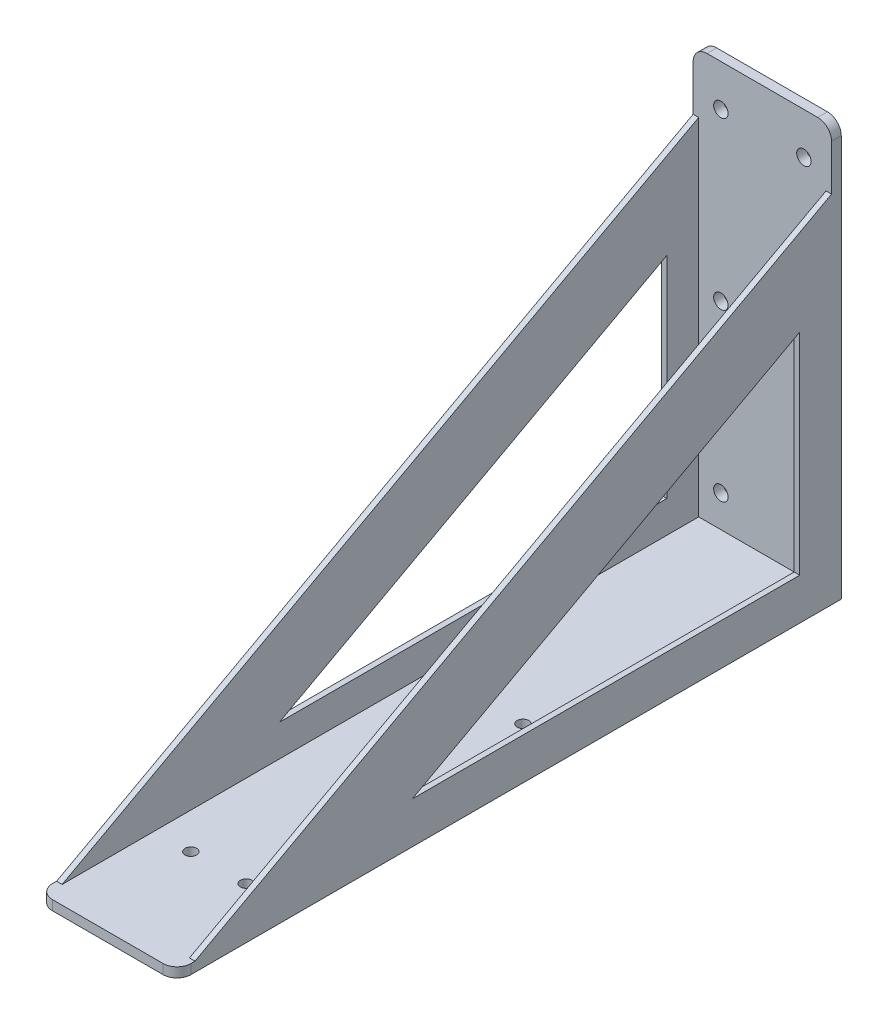
ISO-10303-21;
HEADER;
FILE_DESCRIPTION(('STEP AP214'),'2;1');
FILE_NAME('part.step','',(''),(''),'','','');
FILE_SCHEMA(('AUTOMOTIVE_DESIGN { 1 0 10303 214 1 1 1 1 }'));
ENDSEC;
DATA;
#1=APPLICATION_CONTEXT('core data for automotive mechanical design processes');
#2=APPLICATION_PROTOCOL_DEFINITION('international standard','automotive_design',2000,#1);
#3=PRODUCT_CONTEXT('',#1,'mechanical');
#4=PRODUCT('Part','Part','',(#3));
#5=PRODUCT_RELATED_PRODUCT_CATEGORY('part','',(#4));
#6=PRODUCT_DEFINITION_FORMATION('','',#4);
#7=PRODUCT_DEFINITION_CONTEXT('part definition',#1,'design');
#8=PRODUCT_DEFINITION('design','',#6,#7);
#9=PRODUCT_DEFINITION_SHAPE('','',#8);
#10=(LENGTH_UNIT() NAMED_UNIT(*) SI_UNIT(.MILLI.,.METRE.));
#11=(NAMED_UNIT(*) PLANE_ANGLE_UNIT() SI_UNIT($,.RADIAN.));
#12=(NAMED_UNIT(*) SI_UNIT($,.STERADIAN.) SOLID_ANGLE_UNIT());
#13=UNCERTAINTY_MEASURE_WITH_UNIT(LENGTH_MEASURE(1.E-05),#10,'distance_accuracy_value','');
#14=(GEOMETRIC_REPRESENTATION_CONTEXT(3) GLOBAL_UNCERTAINTY_ASSIGNED_CONTEXT((#13)) GLOBAL_UNIT_ASSIGNED_CONTEXT((#10,
#11,#12)) REPRESENTATION_CONTEXT('',''));
#15=CARTESIAN_POINT('',(0.,0.,0.));
#16=DIRECTION('',(0.,0.,1.));
#17=DIRECTION('',(1.,0.,0.));
#18=AXIS2_PLACEMENT_3D('',#15,#16,#17);
#19=CARTESIAN_POINT('',(25.,3.5,240.));
#20=DIRECTION('',(0.,0.,-1.));
#21=DIRECTION('',(-1.,0.,0.));
#22=AXIS2_PLACEMENT_3D('',#19,#20,#21);
#23=PLANE('',#22);
#24=DIRECTION('',(-1.,0.,0.));
#25=VECTOR('',#24,1.);
#26=CARTESIAN_POINT('',(25.,0.,240.));
#27=LINE('',#26,#25);
#28=CARTESIAN_POINT('',(20.,0.,240.));
#29=VERTEX_POINT('',#28);
#30=CARTESIAN_POINT('',(-20.,0.,240.));
#31=VERTEX_POINT('',#30);
#32=EDGE_CURVE('E366',#29,#31,#27,.T.);
#33=ORIENTED_EDGE('',*,*,#32,.F.);
#34=DIRECTION('',(0.,-1.,0.));
#35=VECTOR('',#34,1.);
#36=CARTESIAN_POINT('',(20.,3.5,240.));
#37=LINE('',#36,#35);
#38=CARTESIAN_POINT('',(20.,3.5,240.));
#39=VERTEX_POINT('',#38);
#40=EDGE_CURVE('E406',#29,#39,#37,.F.);
#41=ORIENTED_EDGE('',*,*,#40,.T.);
#42=DIRECTION('',(-1.,0.,0.));
#43=VECTOR('',#42,1.);
#44=CARTESIAN_POINT('',(25.,3.5,240.));
#45=LINE('',#44,#43);
#46=CARTESIAN_POINT('',(-20.,3.5,240.));
#47=VERTEX_POINT('',#46);
#48=EDGE_CURVE('E333',#39,#47,#45,.T.);
#49=ORIENTED_EDGE('',*,*,#48,.T.);
#50=DIRECTION('',(0.,-1.,0.));
#51=VECTOR('',#50,1.);
#52=CARTESIAN_POINT('',(-20.,3.5,240.));
#53=LINE('',#52,#51);
#54=EDGE_CURVE('E402',#47,#31,#53,.T.);
#55=ORIENTED_EDGE('',*,*,#54,.T.);
#56=EDGE_LOOP('',(#33,#41,#49,#55));
#57=FACE_BOUND('',#56,.T.);
#58=ADVANCED_FACE('F39',(#57),#23,.F.);
#59=CARTESIAN_POINT('',(25.,0.,240.));
#60=DIRECTION('',(0.,1.,0.));
#61=DIRECTION('',(0.,0.,1.));
#62=AXIS2_PLACEMENT_3D('',#59,#60,#61);
#63=PLANE('',#62);
#64=CARTESIAN_POINT('',(10.,0.,200.));
#65=DIRECTION('',(0.,-1.,0.));
#66=DIRECTION('',(0.,0.,1.));
#67=AXIS2_PLACEMENT_3D('',#64,#65,#66);
#68=CIRCLE('',#67,2.09999999999999);
#69=CARTESIAN_POINT('',(10.,0.,202.1));
#70=VERTEX_POINT('',#69);
#71=EDGE_CURVE('E272',#70,#70,#68,.T.);
#72=ORIENTED_EDGE('',*,*,#71,.F.);
#73=EDGE_LOOP('',(#72));
#74=FACE_BOUND('',#73,.T.);
#75=CARTESIAN_POINT('',(9.99999999999999,0.,100.));
#76=DIRECTION('',(0.,-1.,0.));
#77=DIRECTION('',(0.,0.,1.));
#78=AXIS2_PLACEMENT_3D('',#75,#76,#77);
#79=CIRCLE('',#78,2.1);
#80=CARTESIAN_POINT('',(9.99999999999999,0.,102.1));
#81=VERTEX_POINT('',#80);
#82=EDGE_CURVE('E281',#81,#81,#79,.T.);
#83=ORIENTED_EDGE('',*,*,#82,.F.);
#84=EDGE_LOOP('',(#83));
#85=FACE_BOUND('',#84,.T.);
#86=CARTESIAN_POINT('',(-9.99999999999999,0.,100.));
#87=DIRECTION('',(0.,-1.,0.));
#88=DIRECTION('',(0.,0.,-1.));
#89=AXIS2_PLACEMENT_3D('',#86,#87,#88);
#90=CIRCLE('',#89,2.1);
#91=CARTESIAN_POINT('',(-9.99999999999999,0.,97.9));
#92=VERTEX_POINT('',#91);
#93=EDGE_CURVE('E276',#92,#92,#90,.T.);
#94=ORIENTED_EDGE('',*,*,#93,.F.);
#95=EDGE_LOOP('',(#94));
#96=FACE_BOUND('',#95,.T.);
#97=CARTESIAN_POINT('',(-9.99999999999998,0.,200.));
#98=DIRECTION('',(0.,-1.,0.));
#99=DIRECTION('',(0.,0.,-1.));
#100=AXIS2_PLACEMENT_3D('',#97,#98,#99);
#101=CIRCLE('',#100,2.09999999999999);
#102=CARTESIAN_POINT('',(-9.99999999999998,0.,197.9));
#103=VERTEX_POINT('',#102);
#104=EDGE_CURVE('E280',#103,#103,#101,.T.);
#105=ORIENTED_EDGE('',*,*,#104,.F.);
#106=EDGE_LOOP('',(#105));
#107=FACE_BOUND('',#106,.T.);
#108=DIRECTION('',(0.,0.,-1.));
#109=VECTOR('',#108,1.);
#110=CARTESIAN_POINT('',(25.,0.,240.));
#111=LINE('',#110,#109);
#112=CARTESIAN_POINT('',(25.,0.,235.));
#113=VERTEX_POINT('',#112);
#114=CARTESIAN_POINT('',(25.,0.,0.));
#115=VERTEX_POINT('',#114);
#116=EDGE_CURVE('E318',#113,#115,#111,.T.);
#117=ORIENTED_EDGE('',*,*,#116,.F.);
#118=CARTESIAN_POINT('',(20.,0.,235.));
#119=DIRECTION('',(0.,1.,0.));
#120=DIRECTION('',(0.,0.,1.));
#121=AXIS2_PLACEMENT_3D('',#118,#119,#120);
#122=CIRCLE('',#121,5.);
#123=EDGE_CURVE('E399',#113,#29,#122,.F.);
#124=ORIENTED_EDGE('',*,*,#123,.T.);
#125=ORIENTED_EDGE('',*,*,#32,.T.);
#126=CARTESIAN_POINT('',(-20.,0.,235.));
#127=DIRECTION('',(0.,1.,0.));
#128=DIRECTION('',(0.,0.,1.));
#129=AXIS2_PLACEMENT_3D('',#126,#127,#128);
#130=CIRCLE('',#129,5.);
#131=CARTESIAN_POINT('',(-25.,0.,235.));
#132=VERTEX_POINT('',#131);
#133=EDGE_CURVE('E396',#31,#132,#130,.F.);
#134=ORIENTED_EDGE('',*,*,#133,.T.);
#135=DIRECTION('',(0.,0.,-1.));
#136=VECTOR('',#135,1.);
#137=CARTESIAN_POINT('',(-25.,0.,240.));
#138=LINE('',#137,#136);
#139=CARTESIAN_POINT('',(-25.,0.,0.));
#140=VERTEX_POINT('',#139);
#141=EDGE_CURVE('E334',#132,#140,#138,.T.);
#142=ORIENTED_EDGE('',*,*,#141,.T.);
#143=DIRECTION('',(-1.,0.,0.));
#144=VECTOR('',#143,1.);
#145=CARTESIAN_POINT('',(25.,0.,0.));
#146=LINE('',#145,#144);
#147=EDGE_CURVE('E362',#115,#140,#146,.T.);
#148=ORIENTED_EDGE('',*,*,#147,.F.);
#149=EDGE_LOOP('',(#117,#124,#125,#134,#142,#148));
#150=FACE_BOUND('',#149,.T.);
#151=ADVANCED_FACE('F510',(#74,#85,#96,#107,#150),#63,.F.);
#152=CARTESIAN_POINT('',(25.,0.,0.));
#153=DIRECTION('',(0.,0.,1.));
#154=DIRECTION('',(1.,0.,0.));
#155=AXIS2_PLACEMENT_3D('',#152,#153,#154);
#156=PLANE('',#155);
#157=CARTESIAN_POINT('',(-15.,135.,0.));
#158=DIRECTION('',(0.,0.,-1.));
#159=DIRECTION('',(1.,0.,0.));
#160=AXIS2_PLACEMENT_3D('',#157,#158,#159);
#161=CIRCLE('',#160,2.6);
#162=CARTESIAN_POINT('',(-12.4,135.,0.));
#163=VERTEX_POINT('',#162);
#164=EDGE_CURVE('E298',#163,#163,#161,.T.);
#165=ORIENTED_EDGE('',*,*,#164,.F.);
#166=EDGE_LOOP('',(#165));
#167=FACE_BOUND('',#166,.T.);
#168=CARTESIAN_POINT('',(-15.,15.,0.));
#169=DIRECTION('',(0.,0.,-1.));
#170=DIRECTION('',(-1.,0.,0.));
#171=AXIS2_PLACEMENT_3D('',#168,#169,#170);
#172=CIRCLE('',#171,2.6);
#173=CARTESIAN_POINT('',(-17.6,15.,0.));
#174=VERTEX_POINT('',#173);
#175=EDGE_CURVE('E303',#174,#174,#172,.T.);
#176=ORIENTED_EDGE('',*,*,#175,.F.);
#177=EDGE_LOOP('',(#176));
#178=FACE_BOUND('',#177,.T.);
#179=CARTESIAN_POINT('',(15.,15.,0.));
#180=DIRECTION('',(0.,0.,-1.));
#181=DIRECTION('',(1.,0.,0.));
#182=AXIS2_PLACEMENT_3D('',#179,#180,#181);
#183=CIRCLE('',#182,2.6);
#184=CARTESIAN_POINT('',(17.6,15.,0.));
#185=VERTEX_POINT('',#184);
#186=EDGE_CURVE('E307',#185,#185,#183,.T.);
#187=ORIENTED_EDGE('',*,*,#186,.F.);
#188=EDGE_LOOP('',(#187));
#189=FACE_BOUND('',#188,.T.);
#190=CARTESIAN_POINT('',(15.,75.,0.));
#191=DIRECTION('',(0.,0.,-1.));
#192=DIRECTION('',(-1.,0.,0.));
#193=AXIS2_PLACEMENT_3D('',#190,#191,#192);
#194=CIRCLE('',#193,2.6);
#195=CARTESIAN_POINT('',(12.4,75.,0.));
#196=VERTEX_POINT('',#195);
#197=EDGE_CURVE('E296',#196,#196,#194,.T.);
#198=ORIENTED_EDGE('',*,*,#197,.F.);
#199=EDGE_LOOP('',(#198));
#200=FACE_BOUND('',#199,.T.);
#201=CARTESIAN_POINT('',(-15.,75.,0.));
#202=DIRECTION('',(0.,0.,-1.));
#203=DIRECTION('',(-1.,0.,0.));
#204=AXIS2_PLACEMENT_3D('',#201,#202,#203);
#205=CIRCLE('',#204,2.6);
#206=CARTESIAN_POINT('',(-17.6,75.,0.));
#207=VERTEX_POINT('',#206);
#208=EDGE_CURVE('E292',#207,#207,#205,.T.);
#209=ORIENTED_EDGE('',*,*,#208,.F.);
#210=EDGE_LOOP('',(#209));
#211=FACE_BOUND('',#210,.T.);
#212=CARTESIAN_POINT('',(15.,135.,0.));
#213=DIRECTION('',(0.,0.,-1.));
#214=DIRECTION('',(-1.,0.,0.));
#215=AXIS2_PLACEMENT_3D('',#212,#213,#214);
#216=CIRCLE('',#215,2.6);
#217=CARTESIAN_POINT('',(12.4,135.,0.));
#218=VERTEX_POINT('',#217);
#219=EDGE_CURVE('E302',#218,#218,#216,.T.);
#220=ORIENTED_EDGE('',*,*,#219,.F.);
#221=EDGE_LOOP('',(#220));
#222=FACE_BOUND('',#221,.T.);
#223=DIRECTION('',(-1.,0.,0.));
#224=VECTOR('',#223,1.);
#225=CARTESIAN_POINT('',(25.,150.,0.));
#226=LINE('',#225,#224);
#227=CARTESIAN_POINT('',(20.,150.,0.));
#228=VERTEX_POINT('',#227);
#229=CARTESIAN_POINT('',(-20.,150.,0.));
#230=VERTEX_POINT('',#229);
#231=EDGE_CURVE('E358',#228,#230,#226,.T.);
#232=ORIENTED_EDGE('',*,*,#231,.F.);
#233=CARTESIAN_POINT('',(20.,145.,0.));
#234=DIRECTION('',(0.,0.,1.));
#235=DIRECTION('',(1.,0.,0.));
#236=AXIS2_PLACEMENT_3D('',#233,#234,#235);
#237=CIRCLE('',#236,5.);
#238=CARTESIAN_POINT('',(25.,145.,0.));
#239=VERTEX_POINT('',#238);
#240=EDGE_CURVE('E440',#228,#239,#237,.F.);
#241=ORIENTED_EDGE('',*,*,#240,.T.);
#242=DIRECTION('',(0.,1.,0.));
#243=VECTOR('',#242,1.);
#244=CARTESIAN_POINT('',(25.,0.,0.));
#245=LINE('',#244,#243);
#246=EDGE_CURVE('E321',#115,#239,#245,.T.);
#247=ORIENTED_EDGE('',*,*,#246,.F.);
#248=ORIENTED_EDGE('',*,*,#147,.T.);
#249=DIRECTION('',(0.,1.,0.));
#250=VECTOR('',#249,1.);
#251=CARTESIAN_POINT('',(-25.,0.,0.));
#252=LINE('',#251,#250);
#253=CARTESIAN_POINT('',(-25.,145.,0.));
#254=VERTEX_POINT('',#253);
#255=EDGE_CURVE('E337',#140,#254,#252,.T.);
#256=ORIENTED_EDGE('',*,*,#255,.T.);
#257=CARTESIAN_POINT('',(-20.,145.,0.));
#258=DIRECTION('',(0.,0.,1.));
#259=DIRECTION('',(1.,0.,0.));
#260=AXIS2_PLACEMENT_3D('',#257,#258,#259);
#261=CIRCLE('',#260,5.);
#262=EDGE_CURVE('E437',#254,#230,#261,.F.);
#263=ORIENTED_EDGE('',*,*,#262,.T.);
#264=EDGE_LOOP('',(#232,#241,#247,#248,#256,#263));
#265=FACE_BOUND('',#264,.T.);
#266=ADVANCED_FACE('F495',(#167,#178,#189,#200,#211,#222,#265),#156,.F.);
#267=CARTESIAN_POINT('',(25.,150.,0.));
#268=DIRECTION('',(0.,-1.,0.));
#269=DIRECTION('',(0.,0.,-1.));
#270=AXIS2_PLACEMENT_3D('',#267,#268,#269);
#271=PLANE('',#270);
#272=DIRECTION('',(-1.,0.,0.));
#273=VECTOR('',#272,1.);
#274=CARTESIAN_POINT('',(25.,150.,3.5));
#275=LINE('',#274,#273);
#276=CARTESIAN_POINT('',(20.,150.,3.5));
#277=VERTEX_POINT('',#276);
#278=CARTESIAN_POINT('',(-20.,150.,3.5));
#279=VERTEX_POINT('',#278);
#280=EDGE_CURVE('E354',#277,#279,#275,.T.);
#281=ORIENTED_EDGE('',*,*,#280,.F.);
#282=DIRECTION('',(0.,0.,1.));
#283=VECTOR('',#282,1.);
#284=CARTESIAN_POINT('',(20.,150.,0.));
#285=LINE('',#284,#283);
#286=EDGE_CURVE('E434',#277,#228,#285,.F.);
#287=ORIENTED_EDGE('',*,*,#286,.T.);
#288=ORIENTED_EDGE('',*,*,#231,.T.);
#289=DIRECTION('',(0.,0.,1.));
#290=VECTOR('',#289,1.);
#291=CARTESIAN_POINT('',(-20.,150.,0.));
#292=LINE('',#291,#290);
#293=EDGE_CURVE('E430',#230,#279,#292,.T.);
#294=ORIENTED_EDGE('',*,*,#293,.T.);
#295=EDGE_LOOP('',(#281,#287,#288,#294));
#296=FACE_BOUND('',#295,.T.);
#297=ADVANCED_FACE('F499',(#296),#271,.F.);
#298=CARTESIAN_POINT('',(25.,150.,3.5));
#299=DIRECTION('',(0.,0.,-1.));
#300=DIRECTION('',(0.,1.,0.));
#301=AXIS2_PLACEMENT_3D('',#298,#299,#300);
#302=PLANE('',#301);
#303=CARTESIAN_POINT('',(-15.,135.,3.5));
#304=DIRECTION('',(0.,0.,-1.));
#305=DIRECTION('',(0.,1.,0.));
#306=AXIS2_PLACEMENT_3D('',#303,#304,#305);
#307=CIRCLE('',#306,2.6);
#308=CARTESIAN_POINT('',(-15.,137.6,3.5));
#309=VERTEX_POINT('',#308);
#310=EDGE_CURVE('E338',#309,#309,#307,.T.);
#311=ORIENTED_EDGE('',*,*,#310,.T.);
#312=EDGE_LOOP('',(#311));
#313=FACE_BOUND('',#312,.T.);
#314=CARTESIAN_POINT('',(-15.,15.,3.5));
#315=DIRECTION('',(0.,0.,-1.));
#316=DIRECTION('',(0.,1.,0.));
#317=AXIS2_PLACEMENT_3D('',#314,#315,#316);
#318=CIRCLE('',#317,2.6);
#319=CARTESIAN_POINT('',(-15.,17.6,3.5));
#320=VERTEX_POINT('',#319);
#321=EDGE_CURVE('E386',#320,#320,#318,.T.);
#322=ORIENTED_EDGE('',*,*,#321,.T.);
#323=EDGE_LOOP('',(#322));
#324=FACE_BOUND('',#323,.T.);
#325=CARTESIAN_POINT('',(15.,15.,3.5));
#326=DIRECTION('',(0.,0.,-1.));
#327=DIRECTION('',(0.,1.,0.));
#328=AXIS2_PLACEMENT_3D('',#325,#326,#327);
#329=CIRCLE('',#328,2.6);
#330=CARTESIAN_POINT('',(15.,17.6,3.5));
#331=VERTEX_POINT('',#330);
#332=EDGE_CURVE('E382',#331,#331,#329,.T.);
#333=ORIENTED_EDGE('',*,*,#332,.T.);
#334=EDGE_LOOP('',(#333));
#335=FACE_BOUND('',#334,.T.);
#336=CARTESIAN_POINT('',(15.,75.,3.5));
#337=DIRECTION('',(0.,0.,-1.));
#338=DIRECTION('',(0.,1.,0.));
#339=AXIS2_PLACEMENT_3D('',#336,#337,#338);
#340=CIRCLE('',#339,2.6);
#341=CARTESIAN_POINT('',(15.,77.6,3.5));
#342=VERTEX_POINT('',#341);
#343=EDGE_CURVE('E378',#342,#342,#340,.T.);
#344=ORIENTED_EDGE('',*,*,#343,.T.);
#345=EDGE_LOOP('',(#344));
#346=FACE_BOUND('',#345,.T.);
#347=CARTESIAN_POINT('',(-15.,75.,3.5));
#348=DIRECTION('',(0.,0.,-1.));
#349=DIRECTION('',(0.,1.,0.));
#350=AXIS2_PLACEMENT_3D('',#347,#348,#349);
#351=CIRCLE('',#350,2.6);
#352=CARTESIAN_POINT('',(-15.,77.6,3.5));
#353=VERTEX_POINT('',#352);
#354=EDGE_CURVE('E374',#353,#353,#351,.T.);
#355=ORIENTED_EDGE('',*,*,#354,.T.);
#356=EDGE_LOOP('',(#355));
#357=FACE_BOUND('',#356,.T.);
#358=CARTESIAN_POINT('',(15.,135.,3.5));
#359=DIRECTION('',(0.,0.,-1.));
#360=DIRECTION('',(0.,1.,0.));
#361=AXIS2_PLACEMENT_3D('',#358,#359,#360);
#362=CIRCLE('',#361,2.6);
#363=CARTESIAN_POINT('',(15.,137.6,3.5));
#364=VERTEX_POINT('',#363);
#365=EDGE_CURVE('E317',#364,#364,#362,.T.);
#366=ORIENTED_EDGE('',*,*,#365,.T.);
#367=EDGE_LOOP('',(#366));
#368=FACE_BOUND('',#367,.T.);
#369=DIRECTION('',(0.,-1.,0.));
#370=VECTOR('',#369,1.);
#371=CARTESIAN_POINT('',(-25.,150.,3.5));
#372=LINE('',#371,#370);
#373=CARTESIAN_POINT('',(-25.,145.,3.5));
#374=VERTEX_POINT('',#373);
#375=CARTESIAN_POINT('',(-25.,128.5,3.49999999999999));
#376=VERTEX_POINT('',#375);
#377=EDGE_CURVE('E342',#374,#376,#372,.T.);
#378=ORIENTED_EDGE('',*,*,#377,.T.);
#379=DIRECTION('',(-1.,0.,0.));
#380=VECTOR('',#379,1.);
#381=CARTESIAN_POINT('',(-23.,128.5,3.5));
#382=LINE('',#381,#380);
#383=CARTESIAN_POINT('',(-23.,128.5,3.5));
#384=VERTEX_POINT('',#383);
#385=EDGE_CURVE('E246',#384,#376,#382,.T.);
#386=ORIENTED_EDGE('',*,*,#385,.F.);
#387=DIRECTION('',(0.,-1.,0.));
#388=VECTOR('',#387,1.);
#389=CARTESIAN_POINT('',(-23.,128.5,3.5));
#390=LINE('',#389,#388);
#391=CARTESIAN_POINT('',(-23.,3.50000000000003,3.49999999999999));
#392=VERTEX_POINT('',#391);
#393=EDGE_CURVE('E232',#384,#392,#390,.T.);
#394=ORIENTED_EDGE('',*,*,#393,.T.);
#395=DIRECTION('',(-1.,0.,0.));
#396=VECTOR('',#395,1.);
#397=CARTESIAN_POINT('',(25.,3.50000000000003,3.49999999999999));
#398=LINE('',#397,#396);
#399=CARTESIAN_POINT('',(23.,3.50000000000003,3.49999999999999));
#400=VERTEX_POINT('',#399);
#401=EDGE_CURVE('E350',#400,#392,#398,.T.);
#402=ORIENTED_EDGE('',*,*,#401,.F.);
#403=DIRECTION('',(0.,1.,0.));
#404=VECTOR('',#403,1.);
#405=CARTESIAN_POINT('',(23.,128.5,3.5));
#406=LINE('',#405,#404);
#407=CARTESIAN_POINT('',(23.,128.5,3.5));
#408=VERTEX_POINT('',#407);
#409=EDGE_CURVE('E254',#400,#408,#406,.T.);
#410=ORIENTED_EDGE('',*,*,#409,.T.);
#411=DIRECTION('',(1.,0.,0.));
#412=VECTOR('',#411,1.);
#413=CARTESIAN_POINT('',(23.,128.5,3.5));
#414=LINE('',#413,#412);
#415=CARTESIAN_POINT('',(25.,128.5,3.5));
#416=VERTEX_POINT('',#415);
#417=EDGE_CURVE('E265',#408,#416,#414,.T.);
#418=ORIENTED_EDGE('',*,*,#417,.T.);
#419=DIRECTION('',(0.,-1.,0.));
#420=VECTOR('',#419,1.);
#421=CARTESIAN_POINT('',(25.,150.,3.5));
#422=LINE('',#421,#420);
#423=CARTESIAN_POINT('',(25.,145.,3.5));
#424=VERTEX_POINT('',#423);
#425=EDGE_CURVE('E326',#424,#416,#422,.T.);
#426=ORIENTED_EDGE('',*,*,#425,.F.);
#427=CARTESIAN_POINT('',(20.,145.,3.5));
#428=DIRECTION('',(0.,0.,-1.));
#429=DIRECTION('',(0.,1.,0.));
#430=AXIS2_PLACEMENT_3D('',#427,#428,#429);
#431=CIRCLE('',#430,5.);
#432=EDGE_CURVE('E427',#424,#277,#431,.F.);
#433=ORIENTED_EDGE('',*,*,#432,.T.);
#434=ORIENTED_EDGE('',*,*,#280,.T.);
#435=CARTESIAN_POINT('',(-20.,145.,3.5));
#436=DIRECTION('',(0.,0.,-1.));
#437=DIRECTION('',(0.,1.,0.));
#438=AXIS2_PLACEMENT_3D('',#435,#436,#437);
#439=CIRCLE('',#438,5.);
#440=EDGE_CURVE('E424',#279,#374,#439,.F.);
#441=ORIENTED_EDGE('',*,*,#440,.T.);
#442=EDGE_LOOP('',(#378,#386,#394,#402,#410,#418,#426,#433,#434,#441));
#443=FACE_BOUND('',#442,.T.);
#444=ADVANCED_FACE('F536',(#313,#324,#335,#346,#357,#368,#443),#302,.F.);
#445=CARTESIAN_POINT('',(25.,3.50000000000003,3.49999999999999));
#446=DIRECTION('',(0.,-1.,0.));
#447=DIRECTION('',(0.,0.,-1.));
#448=AXIS2_PLACEMENT_3D('',#445,#446,#447);
#449=PLANE('',#448);
#450=CARTESIAN_POINT('',(10.,3.5,200.));
#451=DIRECTION('',(0.,-1.,0.));
#452=DIRECTION('',(0.,0.,-1.));
#453=AXIS2_PLACEMENT_3D('',#450,#451,#452);
#454=CIRCLE('',#453,2.09999999999999);
#455=CARTESIAN_POINT('',(10.,3.5,197.9));
#456=VERTEX_POINT('',#455);
#457=EDGE_CURVE('E297',#456,#456,#454,.T.);
#458=ORIENTED_EDGE('',*,*,#457,.T.);
#459=EDGE_LOOP('',(#458));
#460=FACE_BOUND('',#459,.T.);
#461=CARTESIAN_POINT('',(9.99999999999999,3.50000000000003,100.));
#462=DIRECTION('',(0.,-1.,0.));
#463=DIRECTION('',(0.,0.,-1.));
#464=AXIS2_PLACEMENT_3D('',#461,#462,#463);
#465=CIRCLE('',#464,2.1);
#466=CARTESIAN_POINT('',(9.99999999999999,3.50000000000003,97.9));
#467=VERTEX_POINT('',#466);
#468=EDGE_CURVE('E454',#467,#467,#465,.T.);
#469=ORIENTED_EDGE('',*,*,#468,.T.);
#470=EDGE_LOOP('',(#469));
#471=FACE_BOUND('',#470,.T.);
#472=CARTESIAN_POINT('',(-9.99999999999999,3.50000000000003,100.));
#473=DIRECTION('',(0.,-1.,0.));
#474=DIRECTION('',(0.,0.,-1.));
#475=AXIS2_PLACEMENT_3D('',#472,#473,#474);
#476=CIRCLE('',#475,2.1);
#477=CARTESIAN_POINT('',(-9.99999999999999,3.50000000000003,97.9));
#478=VERTEX_POINT('',#477);
#479=EDGE_CURVE('E450',#478,#478,#476,.T.);
#480=ORIENTED_EDGE('',*,*,#479,.T.);
#481=EDGE_LOOP('',(#480));
#482=FACE_BOUND('',#481,.T.);
#483=CARTESIAN_POINT('',(-9.99999999999998,3.5,200.));
#484=DIRECTION('',(0.,-1.,0.));
#485=DIRECTION('',(0.,0.,-1.));
#486=AXIS2_PLACEMENT_3D('',#483,#484,#485);
#487=CIRCLE('',#486,2.09999999999999);
#488=CARTESIAN_POINT('',(-9.99999999999998,3.5,197.9));
#489=VERTEX_POINT('',#488);
#490=EDGE_CURVE('E291',#489,#489,#487,.T.);
#491=ORIENTED_EDGE('',*,*,#490,.T.);
#492=EDGE_LOOP('',(#491));
#493=FACE_BOUND('',#492,.T.);
#494=DIRECTION('',(0.,0.,1.));
#495=VECTOR('',#494,1.);
#496=CARTESIAN_POINT('',(-23.,3.50000000000003,3.49999999999999));
#497=LINE('',#496,#495);
#498=CARTESIAN_POINT('',(-23.,3.49999999999999,233.5));
#499=VERTEX_POINT('',#498);
#500=EDGE_CURVE('E235',#392,#499,#497,.T.);
#501=ORIENTED_EDGE('',*,*,#500,.T.);
#502=DIRECTION('',(-1.,0.,0.));
#503=VECTOR('',#502,1.);
#504=CARTESIAN_POINT('',(-23.,3.50000000000003,233.5));
#505=LINE('',#504,#503);
#506=CARTESIAN_POINT('',(-25.,3.50000000000003,233.5));
#507=VERTEX_POINT('',#506);
#508=EDGE_CURVE('E242',#499,#507,#505,.T.);
#509=ORIENTED_EDGE('',*,*,#508,.T.);
#510=DIRECTION('',(0.,0.,1.));
#511=VECTOR('',#510,1.);
#512=CARTESIAN_POINT('',(-25.,3.50000000000003,3.49999999999999));
#513=LINE('',#512,#511);
#514=CARTESIAN_POINT('',(-25.,3.5,235.));
#515=VERTEX_POINT('',#514);
#516=EDGE_CURVE('E322',#507,#515,#513,.T.);
#517=ORIENTED_EDGE('',*,*,#516,.T.);
#518=CARTESIAN_POINT('',(-20.,3.5,235.));
#519=DIRECTION('',(0.,-1.,0.));
#520=DIRECTION('',(0.,0.,-1.));
#521=AXIS2_PLACEMENT_3D('',#518,#519,#520);
#522=CIRCLE('',#521,5.);
#523=EDGE_CURVE('E409',#515,#47,#522,.F.);
#524=ORIENTED_EDGE('',*,*,#523,.T.);
#525=ORIENTED_EDGE('',*,*,#48,.F.);
#526=CARTESIAN_POINT('',(20.,3.5,235.));
#527=DIRECTION('',(0.,-1.,0.));
#528=DIRECTION('',(0.,0.,-1.));
#529=AXIS2_PLACEMENT_3D('',#526,#527,#528);
#530=CIRCLE('',#529,5.);
#531=CARTESIAN_POINT('',(25.,3.5,235.));
#532=VERTEX_POINT('',#531);
#533=EDGE_CURVE('E412',#39,#532,#530,.F.);
#534=ORIENTED_EDGE('',*,*,#533,.T.);
#535=DIRECTION('',(0.,0.,1.));
#536=VECTOR('',#535,1.);
#537=CARTESIAN_POINT('',(25.,3.50000000000003,3.49999999999999));
#538=LINE('',#537,#536);
#539=CARTESIAN_POINT('',(25.,3.5,233.5));
#540=VERTEX_POINT('',#539);
#541=EDGE_CURVE('E330',#540,#532,#538,.T.);
#542=ORIENTED_EDGE('',*,*,#541,.F.);
#543=DIRECTION('',(1.,0.,0.));
#544=VECTOR('',#543,1.);
#545=CARTESIAN_POINT('',(23.,3.50000000000003,233.5));
#546=LINE('',#545,#544);
#547=CARTESIAN_POINT('',(23.,3.50000000000003,233.5));
#548=VERTEX_POINT('',#547);
#549=EDGE_CURVE('E268',#548,#540,#546,.T.);
#550=ORIENTED_EDGE('',*,*,#549,.F.);
#551=DIRECTION('',(0.,0.,-1.));
#552=VECTOR('',#551,1.);
#553=CARTESIAN_POINT('',(23.,3.50000000000003,3.49999999999999));
#554=LINE('',#553,#552);
#555=EDGE_CURVE('E261',#548,#400,#554,.T.);
#556=ORIENTED_EDGE('',*,*,#555,.T.);
#557=ORIENTED_EDGE('',*,*,#401,.T.);
#558=EDGE_LOOP('',(#501,#509,#517,#524,#525,#534,#542,#550,#556,#557));
#559=FACE_BOUND('',#558,.T.);
#560=ADVANCED_FACE('F519',(#460,#471,#482,#493,#559),#449,.F.);
#561=CARTESIAN_POINT('',(25.,0.,0.));
#562=DIRECTION('',(1.,0.,0.));
#563=DIRECTION('',(0.,0.,-1.));
#564=AXIS2_PLACEMENT_3D('',#561,#562,#563);
#565=PLANE('',#564);
#566=DIRECTION('',(0.,0.477513320419862,-0.878624509572547));
#567=VECTOR('',#566,1.);
#568=CARTESIAN_POINT('',(25.,15.,155.));
#569=LINE('',#568,#567);
#570=CARTESIAN_POINT('',(25.,15.,155.));
#571=VERTEX_POINT('',#570);
#572=CARTESIAN_POINT('',(25.,91.0869565217392,15.));
#573=VERTEX_POINT('',#572);
#574=EDGE_CURVE('E184',#571,#573,#569,.T.);
#575=ORIENTED_EDGE('',*,*,#574,.T.);
#576=DIRECTION('',(0.,-1.,0.));
#577=VECTOR('',#576,1.);
#578=CARTESIAN_POINT('',(25.,91.0869565217392,15.));
#579=LINE('',#578,#577);
#580=CARTESIAN_POINT('',(25.,15.,15.));
#581=VERTEX_POINT('',#580);
#582=EDGE_CURVE('E194',#573,#581,#579,.T.);
#583=ORIENTED_EDGE('',*,*,#582,.T.);
#584=DIRECTION('',(0.,0.,1.));
#585=VECTOR('',#584,1.);
#586=CARTESIAN_POINT('',(25.,15.,15.));
#587=LINE('',#586,#585);
#588=EDGE_CURVE('E55',#581,#571,#587,.T.);
#589=ORIENTED_EDGE('',*,*,#588,.T.);
#590=EDGE_LOOP('',(#575,#583,#589));
#591=FACE_BOUND('',#590,.T.);
#592=ORIENTED_EDGE('',*,*,#425,.T.);
#593=DIRECTION('',(0.,-0.477513320419862,0.878624509572547));
#594=VECTOR('',#593,1.);
#595=CARTESIAN_POINT('',(25.,3.50000000000003,233.5));
#596=LINE('',#595,#594);
#597=EDGE_CURVE('E250',#416,#540,#596,.T.);
#598=ORIENTED_EDGE('',*,*,#597,.T.);
#599=ORIENTED_EDGE('',*,*,#541,.T.);
#600=DIRECTION('',(0.,-1.,0.));
#601=VECTOR('',#600,1.);
#602=CARTESIAN_POINT('',(25.,0.,235.));
#603=LINE('',#602,#601);
#604=EDGE_CURVE('E370',#532,#113,#603,.T.);
#605=ORIENTED_EDGE('',*,*,#604,.T.);
#606=ORIENTED_EDGE('',*,*,#116,.T.);
#607=ORIENTED_EDGE('',*,*,#246,.T.);
#608=DIRECTION('',(0.,0.,1.));
#609=VECTOR('',#608,1.);
#610=CARTESIAN_POINT('',(25.,145.,3.5));
#611=LINE('',#610,#609);
#612=EDGE_CURVE('E420',#239,#424,#611,.T.);
#613=ORIENTED_EDGE('',*,*,#612,.T.);
#614=EDGE_LOOP('',(#592,#598,#599,#605,#606,#607,#613));
#615=FACE_BOUND('',#614,.T.);
#616=ADVANCED_FACE('F200',(#591,#615),#565,.T.);
#617=CARTESIAN_POINT('',(-25.,0.,0.));
#618=DIRECTION('',(1.,0.,0.));
#619=DIRECTION('',(0.,0.,-1.));
#620=AXIS2_PLACEMENT_3D('',#617,#618,#619);
#621=PLANE('',#620);
#622=DIRECTION('',(0.,-1.,0.));
#623=VECTOR('',#622,1.);
#624=CARTESIAN_POINT('',(-25.,91.0869565217392,15.));
#625=LINE('',#624,#623);
#626=CARTESIAN_POINT('',(-25.,91.0869565217392,15.));
#627=VERTEX_POINT('',#626);
#628=CARTESIAN_POINT('',(-25.,15.,15.));
#629=VERTEX_POINT('',#628);
#630=EDGE_CURVE('E207',#627,#629,#625,.T.);
#631=ORIENTED_EDGE('',*,*,#630,.F.);
#632=DIRECTION('',(0.,0.477513320419862,-0.878624509572547));
#633=VECTOR('',#632,1.);
#634=CARTESIAN_POINT('',(-25.,15.,155.));
#635=LINE('',#634,#633);
#636=CARTESIAN_POINT('',(-25.,15.,155.));
#637=VERTEX_POINT('',#636);
#638=EDGE_CURVE('E63',#637,#627,#635,.T.);
#639=ORIENTED_EDGE('',*,*,#638,.F.);
#640=DIRECTION('',(0.,0.,1.));
#641=VECTOR('',#640,1.);
#642=CARTESIAN_POINT('',(-25.,15.,15.));
#643=LINE('',#642,#641);
#644=EDGE_CURVE('E203',#629,#637,#643,.T.);
#645=ORIENTED_EDGE('',*,*,#644,.F.);
#646=EDGE_LOOP('',(#631,#639,#645));
#647=FACE_BOUND('',#646,.T.);
#648=ORIENTED_EDGE('',*,*,#377,.F.);
#649=DIRECTION('',(0.,0.,1.));
#650=VECTOR('',#649,1.);
#651=CARTESIAN_POINT('',(-25.,145.,0.));
#652=LINE('',#651,#650);
#653=EDGE_CURVE('E443',#374,#254,#652,.F.);
#654=ORIENTED_EDGE('',*,*,#653,.T.);
#655=ORIENTED_EDGE('',*,*,#255,.F.);
#656=ORIENTED_EDGE('',*,*,#141,.F.);
#657=DIRECTION('',(0.,-1.,0.));
#658=VECTOR('',#657,1.);
#659=CARTESIAN_POINT('',(-25.,0.,235.));
#660=LINE('',#659,#658);
#661=EDGE_CURVE('E416',#132,#515,#660,.F.);
#662=ORIENTED_EDGE('',*,*,#661,.T.);
#663=ORIENTED_EDGE('',*,*,#516,.F.);
#664=DIRECTION('',(0.,0.477513320419862,-0.878624509572547));
#665=VECTOR('',#664,1.);
#666=CARTESIAN_POINT('',(-25.,3.50000000000003,233.5));
#667=LINE('',#666,#665);
#668=EDGE_CURVE('E231',#507,#376,#667,.T.);
#669=ORIENTED_EDGE('',*,*,#668,.T.);
#670=EDGE_LOOP('',(#648,#654,#655,#656,#662,#663,#669));
#671=FACE_BOUND('',#670,.T.);
#672=ADVANCED_FACE('F480',(#647,#671),#621,.F.);
#673=CARTESIAN_POINT('',(15.,135.,240.));
#674=DIRECTION('',(0.,0.,-1.));
#675=DIRECTION('',(-1.,0.,0.));
#676=AXIS2_PLACEMENT_3D('',#673,#674,#675);
#677=CYLINDRICAL_SURFACE('',#676,2.6);
#678=ORIENTED_EDGE('',*,*,#219,.T.);
#679=EDGE_LOOP('',(#678));
#680=FACE_BOUND('',#679,.T.);
#681=ORIENTED_EDGE('',*,*,#365,.F.);
#682=EDGE_LOOP('',(#681));
#683=FACE_BOUND('',#682,.T.);
#684=ADVANCED_FACE('F483',(#680,#683),#677,.F.);
#685=CARTESIAN_POINT('',(-15.,75.,240.));
#686=DIRECTION('',(0.,0.,-1.));
#687=DIRECTION('',(-1.,0.,0.));
#688=AXIS2_PLACEMENT_3D('',#685,#686,#687);
#689=CYLINDRICAL_SURFACE('',#688,2.6);
#690=ORIENTED_EDGE('',*,*,#208,.T.);
#691=EDGE_LOOP('',(#690));
#692=FACE_BOUND('',#691,.T.);
#693=ORIENTED_EDGE('',*,*,#354,.F.);
#694=EDGE_LOOP('',(#693));
#695=FACE_BOUND('',#694,.T.);
#696=ADVANCED_FACE('F586',(#692,#695),#689,.F.);
#697=CARTESIAN_POINT('',(15.,75.,240.));
#698=DIRECTION('',(0.,0.,-1.));
#699=DIRECTION('',(-1.,0.,0.));
#700=AXIS2_PLACEMENT_3D('',#697,#698,#699);
#701=CYLINDRICAL_SURFACE('',#700,2.6);
#702=ORIENTED_EDGE('',*,*,#197,.T.);
#703=EDGE_LOOP('',(#702));
#704=FACE_BOUND('',#703,.T.);
#705=ORIENTED_EDGE('',*,*,#343,.F.);
#706=EDGE_LOOP('',(#705));
#707=FACE_BOUND('',#706,.T.);
#708=ADVANCED_FACE('F589',(#704,#707),#701,.F.);
#709=CARTESIAN_POINT('',(15.,15.,240.));
#710=DIRECTION('',(0.,0.,-1.));
#711=DIRECTION('',(-1.,0.,0.));
#712=AXIS2_PLACEMENT_3D('',#709,#710,#711);
#713=CYLINDRICAL_SURFACE('',#712,2.6);
#714=ORIENTED_EDGE('',*,*,#186,.T.);
#715=EDGE_LOOP('',(#714));
#716=FACE_BOUND('',#715,.T.);
#717=ORIENTED_EDGE('',*,*,#332,.F.);
#718=EDGE_LOOP('',(#717));
#719=FACE_BOUND('',#718,.T.);
#720=ADVANCED_FACE('F597',(#716,#719),#713,.F.);
#721=CARTESIAN_POINT('',(-15.,15.,240.));
#722=DIRECTION('',(0.,0.,-1.));
#723=DIRECTION('',(-1.,0.,0.));
#724=AXIS2_PLACEMENT_3D('',#721,#722,#723);
#725=CYLINDRICAL_SURFACE('',#724,2.6);
#726=ORIENTED_EDGE('',*,*,#175,.T.);
#727=EDGE_LOOP('',(#726));
#728=FACE_BOUND('',#727,.T.);
#729=ORIENTED_EDGE('',*,*,#321,.F.);
#730=EDGE_LOOP('',(#729));
#731=FACE_BOUND('',#730,.T.);
#732=ADVANCED_FACE('F593',(#728,#731),#725,.F.);
#733=CARTESIAN_POINT('',(-15.,135.,240.));
#734=DIRECTION('',(0.,0.,-1.));
#735=DIRECTION('',(-1.,0.,0.));
#736=AXIS2_PLACEMENT_3D('',#733,#734,#735);
#737=CYLINDRICAL_SURFACE('',#736,2.6);
#738=ORIENTED_EDGE('',*,*,#164,.T.);
#739=EDGE_LOOP('',(#738));
#740=FACE_BOUND('',#739,.T.);
#741=ORIENTED_EDGE('',*,*,#310,.F.);
#742=EDGE_LOOP('',(#741));
#743=FACE_BOUND('',#742,.T.);
#744=ADVANCED_FACE('F562',(#740,#743),#737,.F.);
#745=CARTESIAN_POINT('',(20.,0.,235.));
#746=DIRECTION('',(0.,1.,0.));
#747=DIRECTION('',(0.,0.,1.));
#748=AXIS2_PLACEMENT_3D('',#745,#746,#747);
#749=CYLINDRICAL_SURFACE('',#748,5.);
#750=ORIENTED_EDGE('',*,*,#533,.F.);
#751=ORIENTED_EDGE('',*,*,#40,.F.);
#752=ORIENTED_EDGE('',*,*,#123,.F.);
#753=ORIENTED_EDGE('',*,*,#604,.F.);
#754=EDGE_LOOP('',(#750,#751,#752,#753));
#755=FACE_BOUND('',#754,.T.);
#756=ADVANCED_FACE('F525',(#755),#749,.T.);
#757=CARTESIAN_POINT('',(-20.,3.5,235.));
#758=DIRECTION('',(0.,-1.,0.));
#759=DIRECTION('',(0.,0.,-1.));
#760=AXIS2_PLACEMENT_3D('',#757,#758,#759);
#761=CYLINDRICAL_SURFACE('',#760,5.);
#762=ORIENTED_EDGE('',*,*,#523,.F.);
#763=ORIENTED_EDGE('',*,*,#661,.F.);
#764=ORIENTED_EDGE('',*,*,#133,.F.);
#765=ORIENTED_EDGE('',*,*,#54,.F.);
#766=EDGE_LOOP('',(#762,#763,#764,#765));
#767=FACE_BOUND('',#766,.T.);
#768=ADVANCED_FACE('F515',(#767),#761,.T.);
#769=CARTESIAN_POINT('',(20.,145.,0.));
#770=DIRECTION('',(0.,0.,-1.));
#771=DIRECTION('',(-1.,0.,0.));
#772=AXIS2_PLACEMENT_3D('',#769,#770,#771);
#773=CYLINDRICAL_SURFACE('',#772,5.);
#774=ORIENTED_EDGE('',*,*,#240,.F.);
#775=ORIENTED_EDGE('',*,*,#286,.F.);
#776=ORIENTED_EDGE('',*,*,#432,.F.);
#777=ORIENTED_EDGE('',*,*,#612,.F.);
#778=EDGE_LOOP('',(#774,#775,#776,#777));
#779=FACE_BOUND('',#778,.T.);
#780=ADVANCED_FACE('F502',(#779),#773,.T.);
#781=CARTESIAN_POINT('',(-20.,145.,0.));
#782=DIRECTION('',(0.,0.,1.));
#783=DIRECTION('',(1.,0.,0.));
#784=AXIS2_PLACEMENT_3D('',#781,#782,#783);
#785=CYLINDRICAL_SURFACE('',#784,5.);
#786=ORIENTED_EDGE('',*,*,#262,.F.);
#787=ORIENTED_EDGE('',*,*,#653,.F.);
#788=ORIENTED_EDGE('',*,*,#440,.F.);
#789=ORIENTED_EDGE('',*,*,#293,.F.);
#790=EDGE_LOOP('',(#786,#787,#788,#789));
#791=FACE_BOUND('',#790,.T.);
#792=ADVANCED_FACE('F41',(#791),#785,.T.);
#793=CARTESIAN_POINT('',(-9.99999999999998,150.,200.));
#794=DIRECTION('',(0.,-1.,0.));
#795=DIRECTION('',(0.,0.,-1.));
#796=AXIS2_PLACEMENT_3D('',#793,#794,#795);
#797=CYLINDRICAL_SURFACE('',#796,2.09999999999999);
#798=ORIENTED_EDGE('',*,*,#104,.T.);
#799=EDGE_LOOP('',(#798));
#800=FACE_BOUND('',#799,.T.);
#801=ORIENTED_EDGE('',*,*,#490,.F.);
#802=EDGE_LOOP('',(#801));
#803=FACE_BOUND('',#802,.T.);
#804=ADVANCED_FACE('F568',(#800,#803),#797,.F.);
#805=CARTESIAN_POINT('',(-9.99999999999999,150.,100.));
#806=DIRECTION('',(0.,-1.,0.));
#807=DIRECTION('',(0.,0.,-1.));
#808=AXIS2_PLACEMENT_3D('',#805,#806,#807);
#809=CYLINDRICAL_SURFACE('',#808,2.1);
#810=ORIENTED_EDGE('',*,*,#93,.T.);
#811=EDGE_LOOP('',(#810));
#812=FACE_BOUND('',#811,.T.);
#813=ORIENTED_EDGE('',*,*,#479,.F.);
#814=EDGE_LOOP('',(#813));
#815=FACE_BOUND('',#814,.T.);
#816=ADVANCED_FACE('F572',(#812,#815),#809,.F.);
#817=CARTESIAN_POINT('',(9.99999999999999,150.,100.));
#818=DIRECTION('',(0.,-1.,0.));
#819=DIRECTION('',(0.,0.,-1.));
#820=AXIS2_PLACEMENT_3D('',#817,#818,#819);
#821=CYLINDRICAL_SURFACE('',#820,2.1);
#822=ORIENTED_EDGE('',*,*,#82,.T.);
#823=EDGE_LOOP('',(#822));
#824=FACE_BOUND('',#823,.T.);
#825=ORIENTED_EDGE('',*,*,#468,.F.);
#826=EDGE_LOOP('',(#825));
#827=FACE_BOUND('',#826,.T.);
#828=ADVANCED_FACE('F578',(#824,#827),#821,.F.);
#829=CARTESIAN_POINT('',(10.,150.,200.));
#830=DIRECTION('',(0.,-1.,0.));
#831=DIRECTION('',(0.,0.,-1.));
#832=AXIS2_PLACEMENT_3D('',#829,#830,#831);
#833=CYLINDRICAL_SURFACE('',#832,2.09999999999999);
#834=ORIENTED_EDGE('',*,*,#71,.T.);
#835=EDGE_LOOP('',(#834));
#836=FACE_BOUND('',#835,.T.);
#837=ORIENTED_EDGE('',*,*,#457,.F.);
#838=EDGE_LOOP('',(#837));
#839=FACE_BOUND('',#838,.T.);
#840=ADVANCED_FACE('F584',(#836,#839),#833,.F.);
#841=CARTESIAN_POINT('',(23.,3.50000000000003,233.5));
#842=DIRECTION('',(0.,0.878624509572547,0.477513320419862));
#843=DIRECTION('',(0.,-0.477513320419862,0.878624509572547));
#844=AXIS2_PLACEMENT_3D('',#841,#842,#843);
#845=PLANE('',#844);
#846=ORIENTED_EDGE('',*,*,#597,.F.);
#847=ORIENTED_EDGE('',*,*,#417,.F.);
#848=DIRECTION('',(0.,-0.477513320419862,0.878624509572547));
#849=VECTOR('',#848,1.);
#850=CARTESIAN_POINT('',(23.,3.50000000000003,233.5));
#851=LINE('',#850,#849);
#852=EDGE_CURVE('E258',#408,#548,#851,.T.);
#853=ORIENTED_EDGE('',*,*,#852,.T.);
#854=ORIENTED_EDGE('',*,*,#549,.T.);
#855=EDGE_LOOP('',(#846,#847,#853,#854));
#856=FACE_BOUND('',#855,.T.);
#857=ADVANCED_FACE('F529',(#856),#845,.T.);
#858=CARTESIAN_POINT('',(23.,0.,0.));
#859=DIRECTION('',(-1.,0.,0.));
#860=DIRECTION('',(0.,0.,1.));
#861=AXIS2_PLACEMENT_3D('',#858,#859,#860);
#862=PLANE('',#861);
#863=DIRECTION('',(0.,0.477513320419862,-0.878624509572547));
#864=VECTOR('',#863,1.);
#865=CARTESIAN_POINT('',(23.,76.6107260124042,41.6362641371762));
#866=LINE('',#865,#864);
#867=CARTESIAN_POINT('',(23.,15.,155.));
#868=VERTEX_POINT('',#867);
#869=CARTESIAN_POINT('',(23.,91.0869565217392,15.));
#870=VERTEX_POINT('',#869);
#871=EDGE_CURVE('E186',#868,#870,#866,.T.);
#872=ORIENTED_EDGE('',*,*,#871,.F.);
#873=DIRECTION('',(0.,0.,1.));
#874=VECTOR('',#873,1.);
#875=CARTESIAN_POINT('',(23.,15.,0.));
#876=LINE('',#875,#874);
#877=CARTESIAN_POINT('',(23.,15.,15.));
#878=VERTEX_POINT('',#877);
#879=EDGE_CURVE('E226',#878,#868,#876,.T.);
#880=ORIENTED_EDGE('',*,*,#879,.F.);
#881=DIRECTION('',(0.,-1.,0.));
#882=VECTOR('',#881,1.);
#883=CARTESIAN_POINT('',(23.,0.,15.));
#884=LINE('',#883,#882);
#885=EDGE_CURVE('E220',#870,#878,#884,.T.);
#886=ORIENTED_EDGE('',*,*,#885,.F.);
#887=EDGE_LOOP('',(#872,#880,#886));
#888=FACE_BOUND('',#887,.T.);
#889=ORIENTED_EDGE('',*,*,#409,.F.);
#890=ORIENTED_EDGE('',*,*,#555,.F.);
#891=ORIENTED_EDGE('',*,*,#852,.F.);
#892=EDGE_LOOP('',(#889,#890,#891));
#893=FACE_BOUND('',#892,.T.);
#894=ADVANCED_FACE('F533',(#888,#893),#862,.T.);
#895=CARTESIAN_POINT('',(-23.,3.50000000000003,233.5));
#896=DIRECTION('',(0.,0.878624509572547,0.477513320419862));
#897=DIRECTION('',(0.,-0.477513320419862,0.878624509572547));
#898=AXIS2_PLACEMENT_3D('',#895,#896,#897);
#899=PLANE('',#898);
#900=ORIENTED_EDGE('',*,*,#668,.F.);
#901=ORIENTED_EDGE('',*,*,#508,.F.);
#902=DIRECTION('',(0.,0.477513320419862,-0.878624509572547));
#903=VECTOR('',#902,1.);
#904=CARTESIAN_POINT('',(-23.,3.50000000000003,233.5));
#905=LINE('',#904,#903);
#906=EDGE_CURVE('E238',#499,#384,#905,.T.);
#907=ORIENTED_EDGE('',*,*,#906,.T.);
#908=ORIENTED_EDGE('',*,*,#385,.T.);
#909=EDGE_LOOP('',(#900,#901,#907,#908));
#910=FACE_BOUND('',#909,.T.);
#911=ADVANCED_FACE('F541',(#910),#899,.T.);
#912=CARTESIAN_POINT('',(-23.,0.,0.));
#913=DIRECTION('',(-1.,0.,0.));
#914=DIRECTION('',(0.,0.,1.));
#915=AXIS2_PLACEMENT_3D('',#912,#913,#914);
#916=PLANE('',#915);
#917=DIRECTION('',(0.,0.,1.));
#918=VECTOR('',#917,1.);
#919=CARTESIAN_POINT('',(-23.,15.,0.));
#920=LINE('',#919,#918);
#921=CARTESIAN_POINT('',(-23.,15.,15.));
#922=VERTEX_POINT('',#921);
#923=CARTESIAN_POINT('',(-23.,15.,155.));
#924=VERTEX_POINT('',#923);
#925=EDGE_CURVE('E48',#922,#924,#920,.T.);
#926=ORIENTED_EDGE('',*,*,#925,.T.);
#927=DIRECTION('',(0.,0.477513320419862,-0.878624509572547));
#928=VECTOR('',#927,1.);
#929=CARTESIAN_POINT('',(-23.,76.6107260124042,41.6362641371762));
#930=LINE('',#929,#928);
#931=CARTESIAN_POINT('',(-23.,91.0869565217392,15.));
#932=VERTEX_POINT('',#931);
#933=EDGE_CURVE('E11',#924,#932,#930,.T.);
#934=ORIENTED_EDGE('',*,*,#933,.T.);
#935=DIRECTION('',(0.,-1.,0.));
#936=VECTOR('',#935,1.);
#937=CARTESIAN_POINT('',(-23.,0.,15.));
#938=LINE('',#937,#936);
#939=EDGE_CURVE('E446',#932,#922,#938,.T.);
#940=ORIENTED_EDGE('',*,*,#939,.T.);
#941=EDGE_LOOP('',(#926,#934,#940));
#942=FACE_BOUND('',#941,.T.);
#943=ORIENTED_EDGE('',*,*,#393,.F.);
#944=ORIENTED_EDGE('',*,*,#906,.F.);
#945=ORIENTED_EDGE('',*,*,#500,.F.);
#946=EDGE_LOOP('',(#943,#944,#945));
#947=FACE_BOUND('',#946,.T.);
#948=ADVANCED_FACE('F467',(#942,#947),#916,.F.);
#949=CARTESIAN_POINT('',(25.,91.0869565217392,15.));
#950=DIRECTION('',(0.,0.,-1.));
#951=DIRECTION('',(0.,1.,0.));
#952=AXIS2_PLACEMENT_3D('',#949,#950,#951);
#953=PLANE('',#952);
#954=DIRECTION('',(-1.,0.,0.));
#955=VECTOR('',#954,1.);
#956=CARTESIAN_POINT('',(25.,91.0869565217392,15.));
#957=LINE('',#956,#955);
#958=EDGE_CURVE('E191',#932,#627,#957,.T.);
#959=ORIENTED_EDGE('',*,*,#958,.T.);
#960=ORIENTED_EDGE('',*,*,#630,.T.);
#961=DIRECTION('',(-1.,0.,0.));
#962=VECTOR('',#961,1.);
#963=CARTESIAN_POINT('',(25.,15.,15.));
#964=LINE('',#963,#962);
#965=EDGE_CURVE('E190',#922,#629,#964,.T.);
#966=ORIENTED_EDGE('',*,*,#965,.F.);
#967=ORIENTED_EDGE('',*,*,#939,.F.);
#968=EDGE_LOOP('',(#959,#960,#966,#967));
#969=FACE_BOUND('',#968,.T.);
#970=ADVANCED_FACE('F478',(#969),#953,.F.);
#971=CARTESIAN_POINT('',(25.,15.,15.));
#972=DIRECTION('',(0.,-1.,0.));
#973=DIRECTION('',(0.,0.,-1.));
#974=AXIS2_PLACEMENT_3D('',#971,#972,#973);
#975=PLANE('',#974);
#976=ORIENTED_EDGE('',*,*,#965,.T.);
#977=ORIENTED_EDGE('',*,*,#644,.T.);
#978=DIRECTION('',(-1.,0.,0.));
#979=VECTOR('',#978,1.);
#980=CARTESIAN_POINT('',(25.,15.,155.));
#981=LINE('',#980,#979);
#982=EDGE_CURVE('E221',#924,#637,#981,.T.);
#983=ORIENTED_EDGE('',*,*,#982,.F.);
#984=ORIENTED_EDGE('',*,*,#925,.F.);
#985=EDGE_LOOP('',(#976,#977,#983,#984));
#986=FACE_BOUND('',#985,.T.);
#987=ADVANCED_FACE('F471',(#986),#975,.F.);
#988=CARTESIAN_POINT('',(25.,15.,155.));
#989=DIRECTION('',(0.,0.878624509572547,0.477513320419862));
#990=DIRECTION('',(0.,-0.477513320419862,0.878624509572547));
#991=AXIS2_PLACEMENT_3D('',#988,#989,#990);
#992=PLANE('',#991);
#993=ORIENTED_EDGE('',*,*,#982,.T.);
#994=ORIENTED_EDGE('',*,*,#638,.T.);
#995=ORIENTED_EDGE('',*,*,#958,.F.);
#996=ORIENTED_EDGE('',*,*,#933,.F.);
#997=EDGE_LOOP('',(#993,#994,#995,#996));
#998=FACE_BOUND('',#997,.T.);
#999=ADVANCED_FACE('F784',(#998),#992,.F.);
#1000=ORIENTED_EDGE('',*,*,#871,.T.);
#1001=EDGE_CURVE('E179',#573,#870,#957,.T.);
#1002=ORIENTED_EDGE('',*,*,#1001,.F.);
#1003=ORIENTED_EDGE('',*,*,#574,.F.);
#1004=EDGE_CURVE('E217',#571,#868,#981,.T.);
#1005=ORIENTED_EDGE('',*,*,#1004,.T.);
#1006=EDGE_LOOP('',(#1000,#1002,#1003,#1005));
#1007=FACE_BOUND('',#1006,.T.);
#1008=ADVANCED_FACE('F181',(#1007),#992,.F.);
#1009=ORIENTED_EDGE('',*,*,#879,.T.);
#1010=ORIENTED_EDGE('',*,*,#1004,.F.);
#1011=ORIENTED_EDGE('',*,*,#588,.F.);
#1012=EDGE_CURVE('E196',#581,#878,#964,.T.);
#1013=ORIENTED_EDGE('',*,*,#1012,.T.);
#1014=EDGE_LOOP('',(#1009,#1010,#1011,#1013));
#1015=FACE_BOUND('',#1014,.T.);
#1016=ADVANCED_FACE('F786',(#1015),#975,.F.);
#1017=ORIENTED_EDGE('',*,*,#885,.T.);
#1018=ORIENTED_EDGE('',*,*,#1012,.F.);
#1019=ORIENTED_EDGE('',*,*,#582,.F.);
#1020=ORIENTED_EDGE('',*,*,#1001,.T.);
#1021=EDGE_LOOP('',(#1017,#1018,#1019,#1020));
#1022=FACE_BOUND('',#1021,.T.);
#1023=ADVANCED_FACE('F195',(#1022),#953,.F.);
#1024=CLOSED_SHELL('',(#58,#151,#266,#297,#444,#560,#616,#672,#684,#696,#708,#720,#732,#744,
#756,#768,#780,#792,#804,#816,#828,#840,#857,#894,#911,#948,#970,#987,#999,#1008,#1016,#1023));
#1025=MANIFOLD_SOLID_BREP('B2',#1024);
#1026=ADVANCED_BREP_SHAPE_REPRESENTATION('',(#18,#1025),#14);
#1027=SHAPE_DEFINITION_REPRESENTATION(#9,#1026);
ENDSEC;
END-ISO-10303-21;
